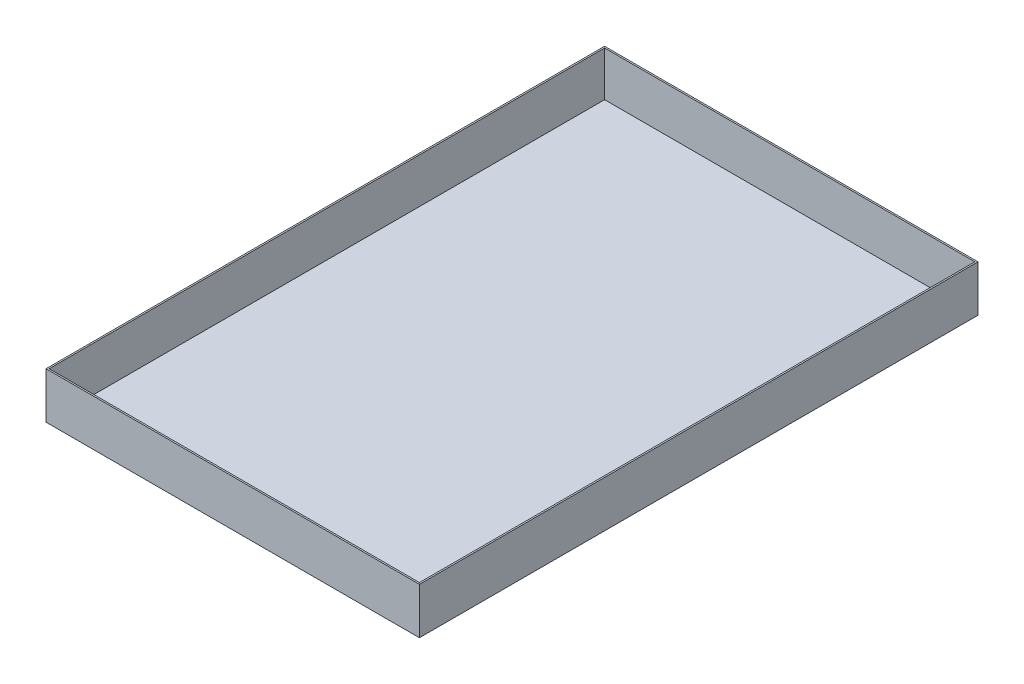
ISO-10303-21;
HEADER;
FILE_DESCRIPTION(('STEP AP214'),'2;1');
FILE_NAME('part.step','',(''),(''),'','','');
FILE_SCHEMA(('AUTOMOTIVE_DESIGN { 1 0 10303 214 1 1 1 1 }'));
ENDSEC;
DATA;
#1=APPLICATION_CONTEXT('core data for automotive mechanical design processes');
#2=APPLICATION_PROTOCOL_DEFINITION('international standard','automotive_design',2000,#1);
#3=PRODUCT_CONTEXT('',#1,'mechanical');
#4=PRODUCT('Part','Part','',(#3));
#5=PRODUCT_RELATED_PRODUCT_CATEGORY('part','',(#4));
#6=PRODUCT_DEFINITION_FORMATION('','',#4);
#7=PRODUCT_DEFINITION_CONTEXT('part definition',#1,'design');
#8=PRODUCT_DEFINITION('design','',#6,#7);
#9=PRODUCT_DEFINITION_SHAPE('','',#8);
#10=(LENGTH_UNIT() NAMED_UNIT(*) SI_UNIT(.MILLI.,.METRE.));
#11=(NAMED_UNIT(*) PLANE_ANGLE_UNIT() SI_UNIT($,.RADIAN.));
#12=(NAMED_UNIT(*) SI_UNIT($,.STERADIAN.) SOLID_ANGLE_UNIT());
#13=UNCERTAINTY_MEASURE_WITH_UNIT(LENGTH_MEASURE(1.E-05),#10,'distance_accuracy_value','');
#14=(GEOMETRIC_REPRESENTATION_CONTEXT(3) GLOBAL_UNCERTAINTY_ASSIGNED_CONTEXT((#13)) GLOBAL_UNIT_ASSIGNED_CONTEXT((#10,
#11,#12)) REPRESENTATION_CONTEXT('',''));
#15=CARTESIAN_POINT('',(0.,0.,0.));
#16=DIRECTION('',(0.,0.,1.));
#17=DIRECTION('',(1.,0.,0.));
#18=AXIS2_PLACEMENT_3D('',#15,#16,#17);
#19=CARTESIAN_POINT('',(0.,76.2,0.));
#20=DIRECTION('',(0.,-1.,0.));
#21=DIRECTION('',(0.,0.,-1.));
#22=AXIS2_PLACEMENT_3D('',#19,#20,#21);
#23=PLANE('',#22);
#24=DIRECTION('',(0.,0.,1.));
#25=VECTOR('',#24,1.);
#26=CARTESIAN_POINT('',(0.,76.2,0.));
#27=LINE('',#26,#25);
#28=CARTESIAN_POINT('',(0.,76.2,-919.48));
#29=VERTEX_POINT('',#28);
#30=CARTESIAN_POINT('',(0.,76.2,0.));
#31=VERTEX_POINT('',#30);
#32=EDGE_CURVE('E141',#29,#31,#27,.T.);
#33=ORIENTED_EDGE('',*,*,#32,.T.);
#34=DIRECTION('',(1.,0.,0.));
#35=VECTOR('',#34,1.);
#36=CARTESIAN_POINT('',(0.,76.2,0.));
#37=LINE('',#36,#35);
#38=CARTESIAN_POINT('',(614.68,76.2,0.));
#39=VERTEX_POINT('',#38);
#40=EDGE_CURVE('E85',#31,#39,#37,.T.);
#41=ORIENTED_EDGE('',*,*,#40,.T.);
#42=DIRECTION('',(0.,0.,-1.));
#43=VECTOR('',#42,1.);
#44=CARTESIAN_POINT('',(614.68,76.2,0.));
#45=LINE('',#44,#43);
#46=CARTESIAN_POINT('',(614.68,76.2,-919.48));
#47=VERTEX_POINT('',#46);
#48=EDGE_CURVE('E144',#39,#47,#45,.T.);
#49=ORIENTED_EDGE('',*,*,#48,.T.);
#50=DIRECTION('',(-1.,0.,0.));
#51=VECTOR('',#50,1.);
#52=CARTESIAN_POINT('',(0.,76.2,-919.48));
#53=LINE('',#52,#51);
#54=EDGE_CURVE('E57',#47,#29,#53,.T.);
#55=ORIENTED_EDGE('',*,*,#54,.T.);
#56=EDGE_LOOP('',(#33,#41,#49,#55));
#57=FACE_BOUND('',#56,.T.);
#58=DIRECTION('',(0.,0.,1.));
#59=VECTOR('',#58,1.);
#60=CARTESIAN_POINT('',(2.54,76.2,0.));
#61=LINE('',#60,#59);
#62=CARTESIAN_POINT('',(2.54,76.2,-916.94));
#63=VERTEX_POINT('',#62);
#64=CARTESIAN_POINT('',(2.54,76.2,-2.54));
#65=VERTEX_POINT('',#64);
#66=EDGE_CURVE('E130',#63,#65,#61,.T.);
#67=ORIENTED_EDGE('',*,*,#66,.F.);
#68=DIRECTION('',(-1.,0.,0.));
#69=VECTOR('',#68,1.);
#70=CARTESIAN_POINT('',(0.,76.2,-916.94));
#71=LINE('',#70,#69);
#72=CARTESIAN_POINT('',(612.14,76.2,-916.94));
#73=VERTEX_POINT('',#72);
#74=EDGE_CURVE('E139',#73,#63,#71,.T.);
#75=ORIENTED_EDGE('',*,*,#74,.F.);
#76=DIRECTION('',(0.,0.,-1.));
#77=VECTOR('',#76,1.);
#78=CARTESIAN_POINT('',(612.14,76.2,0.));
#79=LINE('',#78,#77);
#80=CARTESIAN_POINT('',(612.14,76.2,-2.54));
#81=VERTEX_POINT('',#80);
#82=EDGE_CURVE('E137',#81,#73,#79,.T.);
#83=ORIENTED_EDGE('',*,*,#82,.F.);
#84=DIRECTION('',(1.,0.,0.));
#85=VECTOR('',#84,1.);
#86=CARTESIAN_POINT('',(0.,76.2,-2.54));
#87=LINE('',#86,#85);
#88=EDGE_CURVE('E122',#65,#81,#87,.T.);
#89=ORIENTED_EDGE('',*,*,#88,.F.);
#90=EDGE_LOOP('',(#67,#75,#83,#89));
#91=FACE_BOUND('',#90,.T.);
#92=ADVANCED_FACE('F33',(#57,#91),#23,.F.);
#93=CARTESIAN_POINT('',(0.,76.2,0.));
#94=DIRECTION('',(1.,0.,0.));
#95=DIRECTION('',(0.,0.,-1.));
#96=AXIS2_PLACEMENT_3D('',#93,#94,#95);
#97=PLANE('',#96);
#98=DIRECTION('',(0.,0.,1.));
#99=VECTOR('',#98,1.);
#100=CARTESIAN_POINT('',(0.,0.,0.));
#101=LINE('',#100,#99);
#102=CARTESIAN_POINT('',(0.,0.,-919.48));
#103=VERTEX_POINT('',#102);
#104=CARTESIAN_POINT('',(0.,0.,0.));
#105=VERTEX_POINT('',#104);
#106=EDGE_CURVE('E148',#103,#105,#101,.T.);
#107=ORIENTED_EDGE('',*,*,#106,.T.);
#108=DIRECTION('',(0.,-1.,0.));
#109=VECTOR('',#108,1.);
#110=CARTESIAN_POINT('',(0.,76.2,0.));
#111=LINE('',#110,#109);
#112=EDGE_CURVE('E11',#31,#105,#111,.T.);
#113=ORIENTED_EDGE('',*,*,#112,.F.);
#114=ORIENTED_EDGE('',*,*,#32,.F.);
#115=DIRECTION('',(0.,-1.,0.));
#116=VECTOR('',#115,1.);
#117=CARTESIAN_POINT('',(0.,76.2,-919.48));
#118=LINE('',#117,#116);
#119=EDGE_CURVE('E147',#29,#103,#118,.T.);
#120=ORIENTED_EDGE('',*,*,#119,.T.);
#121=EDGE_LOOP('',(#107,#113,#114,#120));
#122=FACE_BOUND('',#121,.T.);
#123=ADVANCED_FACE('F35',(#122),#97,.F.);
#124=CARTESIAN_POINT('',(0.,76.2,0.));
#125=DIRECTION('',(0.,0.,-1.));
#126=DIRECTION('',(-1.,0.,0.));
#127=AXIS2_PLACEMENT_3D('',#124,#125,#126);
#128=PLANE('',#127);
#129=DIRECTION('',(1.,0.,0.));
#130=VECTOR('',#129,1.);
#131=CARTESIAN_POINT('',(0.,0.,0.));
#132=LINE('',#131,#130);
#133=CARTESIAN_POINT('',(614.68,0.,0.));
#134=VERTEX_POINT('',#133);
#135=EDGE_CURVE('E151',#105,#134,#132,.T.);
#136=ORIENTED_EDGE('',*,*,#135,.T.);
#137=DIRECTION('',(0.,-1.,0.));
#138=VECTOR('',#137,1.);
#139=CARTESIAN_POINT('',(614.68,76.2,0.));
#140=LINE('',#139,#138);
#141=EDGE_CURVE('E41',#39,#134,#140,.T.);
#142=ORIENTED_EDGE('',*,*,#141,.F.);
#143=ORIENTED_EDGE('',*,*,#40,.F.);
#144=ORIENTED_EDGE('',*,*,#112,.T.);
#145=EDGE_LOOP('',(#136,#142,#143,#144));
#146=FACE_BOUND('',#145,.T.);
#147=ADVANCED_FACE('F179',(#146),#128,.F.);
#148=CARTESIAN_POINT('',(614.68,76.2,0.));
#149=DIRECTION('',(-1.,0.,0.));
#150=DIRECTION('',(0.,0.,1.));
#151=AXIS2_PLACEMENT_3D('',#148,#149,#150);
#152=PLANE('',#151);
#153=DIRECTION('',(0.,0.,-1.));
#154=VECTOR('',#153,1.);
#155=CARTESIAN_POINT('',(614.68,0.,0.));
#156=LINE('',#155,#154);
#157=CARTESIAN_POINT('',(614.68,0.,-919.48));
#158=VERTEX_POINT('',#157);
#159=EDGE_CURVE('E153',#134,#158,#156,.T.);
#160=ORIENTED_EDGE('',*,*,#159,.T.);
#161=DIRECTION('',(0.,-1.,0.));
#162=VECTOR('',#161,1.);
#163=CARTESIAN_POINT('',(614.68,76.2,-919.48));
#164=LINE('',#163,#162);
#165=EDGE_CURVE('E157',#47,#158,#164,.T.);
#166=ORIENTED_EDGE('',*,*,#165,.F.);
#167=ORIENTED_EDGE('',*,*,#48,.F.);
#168=ORIENTED_EDGE('',*,*,#141,.T.);
#169=EDGE_LOOP('',(#160,#166,#167,#168));
#170=FACE_BOUND('',#169,.T.);
#171=ADVANCED_FACE('F162',(#170),#152,.F.);
#172=CARTESIAN_POINT('',(0.,76.2,-919.48));
#173=DIRECTION('',(0.,0.,1.));
#174=DIRECTION('',(1.,0.,0.));
#175=AXIS2_PLACEMENT_3D('',#172,#173,#174);
#176=PLANE('',#175);
#177=DIRECTION('',(-1.,0.,0.));
#178=VECTOR('',#177,1.);
#179=CARTESIAN_POINT('',(0.,0.,-919.48));
#180=LINE('',#179,#178);
#181=EDGE_CURVE('E78',#158,#103,#180,.T.);
#182=ORIENTED_EDGE('',*,*,#181,.T.);
#183=ORIENTED_EDGE('',*,*,#119,.F.);
#184=ORIENTED_EDGE('',*,*,#54,.F.);
#185=ORIENTED_EDGE('',*,*,#165,.T.);
#186=EDGE_LOOP('',(#182,#183,#184,#185));
#187=FACE_BOUND('',#186,.T.);
#188=ADVANCED_FACE('F170',(#187),#176,.F.);
#189=CARTESIAN_POINT('',(0.,0.,0.));
#190=DIRECTION('',(0.,-1.,0.));
#191=DIRECTION('',(0.,0.,-1.));
#192=AXIS2_PLACEMENT_3D('',#189,#190,#191);
#193=PLANE('',#192);
#194=ORIENTED_EDGE('',*,*,#106,.F.);
#195=ORIENTED_EDGE('',*,*,#181,.F.);
#196=ORIENTED_EDGE('',*,*,#159,.F.);
#197=ORIENTED_EDGE('',*,*,#135,.F.);
#198=EDGE_LOOP('',(#194,#195,#196,#197));
#199=FACE_BOUND('',#198,.T.);
#200=ADVANCED_FACE('F166',(#199),#193,.T.);
#201=CARTESIAN_POINT('',(2.54,76.2,0.));
#202=DIRECTION('',(1.,0.,0.));
#203=DIRECTION('',(0.,0.,-1.));
#204=AXIS2_PLACEMENT_3D('',#201,#202,#203);
#205=PLANE('',#204);
#206=DIRECTION('',(0.,0.,1.));
#207=VECTOR('',#206,1.);
#208=CARTESIAN_POINT('',(2.54,2.54,0.));
#209=LINE('',#208,#207);
#210=CARTESIAN_POINT('',(2.54,2.54,-916.94));
#211=VERTEX_POINT('',#210);
#212=CARTESIAN_POINT('',(2.54,2.54,-2.54));
#213=VERTEX_POINT('',#212);
#214=EDGE_CURVE('E113',#211,#213,#209,.T.);
#215=ORIENTED_EDGE('',*,*,#214,.F.);
#216=DIRECTION('',(0.,-1.,0.));
#217=VECTOR('',#216,1.);
#218=CARTESIAN_POINT('',(2.54,76.2,-916.94));
#219=LINE('',#218,#217);
#220=EDGE_CURVE('E133',#63,#211,#219,.T.);
#221=ORIENTED_EDGE('',*,*,#220,.F.);
#222=ORIENTED_EDGE('',*,*,#66,.T.);
#223=DIRECTION('',(0.,-1.,0.));
#224=VECTOR('',#223,1.);
#225=CARTESIAN_POINT('',(2.54,76.2,-2.54));
#226=LINE('',#225,#224);
#227=EDGE_CURVE('E125',#65,#213,#226,.T.);
#228=ORIENTED_EDGE('',*,*,#227,.T.);
#229=EDGE_LOOP('',(#215,#221,#222,#228));
#230=FACE_BOUND('',#229,.T.);
#231=ADVANCED_FACE('F177',(#230),#205,.T.);
#232=CARTESIAN_POINT('',(0.,76.2,-2.54));
#233=DIRECTION('',(0.,0.,-1.));
#234=DIRECTION('',(-1.,0.,0.));
#235=AXIS2_PLACEMENT_3D('',#232,#233,#234);
#236=PLANE('',#235);
#237=DIRECTION('',(1.,0.,0.));
#238=VECTOR('',#237,1.);
#239=CARTESIAN_POINT('',(0.,2.54,-2.54));
#240=LINE('',#239,#238);
#241=CARTESIAN_POINT('',(612.14,2.54,-2.54));
#242=VERTEX_POINT('',#241);
#243=EDGE_CURVE('E107',#213,#242,#240,.T.);
#244=ORIENTED_EDGE('',*,*,#243,.F.);
#245=ORIENTED_EDGE('',*,*,#227,.F.);
#246=ORIENTED_EDGE('',*,*,#88,.T.);
#247=DIRECTION('',(0.,-1.,0.));
#248=VECTOR('',#247,1.);
#249=CARTESIAN_POINT('',(612.14,76.2,-2.54));
#250=LINE('',#249,#248);
#251=EDGE_CURVE('E119',#81,#242,#250,.T.);
#252=ORIENTED_EDGE('',*,*,#251,.T.);
#253=EDGE_LOOP('',(#244,#245,#246,#252));
#254=FACE_BOUND('',#253,.T.);
#255=ADVANCED_FACE('F120',(#254),#236,.T.);
#256=CARTESIAN_POINT('',(612.14,76.2,0.));
#257=DIRECTION('',(-1.,0.,0.));
#258=DIRECTION('',(0.,0.,1.));
#259=AXIS2_PLACEMENT_3D('',#256,#257,#258);
#260=PLANE('',#259);
#261=DIRECTION('',(0.,0.,-1.));
#262=VECTOR('',#261,1.);
#263=CARTESIAN_POINT('',(612.14,2.54,0.));
#264=LINE('',#263,#262);
#265=CARTESIAN_POINT('',(612.14,2.54,-916.94));
#266=VERTEX_POINT('',#265);
#267=EDGE_CURVE('E111',#242,#266,#264,.T.);
#268=ORIENTED_EDGE('',*,*,#267,.F.);
#269=ORIENTED_EDGE('',*,*,#251,.F.);
#270=ORIENTED_EDGE('',*,*,#82,.T.);
#271=DIRECTION('',(0.,-1.,0.));
#272=VECTOR('',#271,1.);
#273=CARTESIAN_POINT('',(612.14,76.2,-916.94));
#274=LINE('',#273,#272);
#275=EDGE_CURVE('E48',#73,#266,#274,.T.);
#276=ORIENTED_EDGE('',*,*,#275,.T.);
#277=EDGE_LOOP('',(#268,#269,#270,#276));
#278=FACE_BOUND('',#277,.T.);
#279=ADVANCED_FACE('F127',(#278),#260,.T.);
#280=CARTESIAN_POINT('',(0.,76.2,-916.94));
#281=DIRECTION('',(0.,0.,1.));
#282=DIRECTION('',(1.,0.,0.));
#283=AXIS2_PLACEMENT_3D('',#280,#281,#282);
#284=PLANE('',#283);
#285=DIRECTION('',(-1.,0.,0.));
#286=VECTOR('',#285,1.);
#287=CARTESIAN_POINT('',(0.,2.54,-916.94));
#288=LINE('',#287,#286);
#289=EDGE_CURVE('E128',#266,#211,#288,.T.);
#290=ORIENTED_EDGE('',*,*,#289,.F.);
#291=ORIENTED_EDGE('',*,*,#275,.F.);
#292=ORIENTED_EDGE('',*,*,#74,.T.);
#293=ORIENTED_EDGE('',*,*,#220,.T.);
#294=EDGE_LOOP('',(#290,#291,#292,#293));
#295=FACE_BOUND('',#294,.T.);
#296=ADVANCED_FACE('F190',(#295),#284,.T.);
#297=CARTESIAN_POINT('',(0.,2.54,0.));
#298=DIRECTION('',(0.,-1.,0.));
#299=DIRECTION('',(0.,0.,-1.));
#300=AXIS2_PLACEMENT_3D('',#297,#298,#299);
#301=PLANE('',#300);
#302=ORIENTED_EDGE('',*,*,#214,.T.);
#303=ORIENTED_EDGE('',*,*,#243,.T.);
#304=ORIENTED_EDGE('',*,*,#267,.T.);
#305=ORIENTED_EDGE('',*,*,#289,.T.);
#306=EDGE_LOOP('',(#302,#303,#304,#305));
#307=FACE_BOUND('',#306,.T.);
#308=ADVANCED_FACE('F109',(#307),#301,.F.);
#309=CLOSED_SHELL('',(#92,#123,#147,#171,#188,#200,#231,#255,#279,#296,#308));
#310=MANIFOLD_SOLID_BREP('B2',#309);
#311=ADVANCED_BREP_SHAPE_REPRESENTATION('',(#18,#310),#14);
#312=SHAPE_DEFINITION_REPRESENTATION(#9,#311);
ENDSEC;
END-ISO-10303-21;
